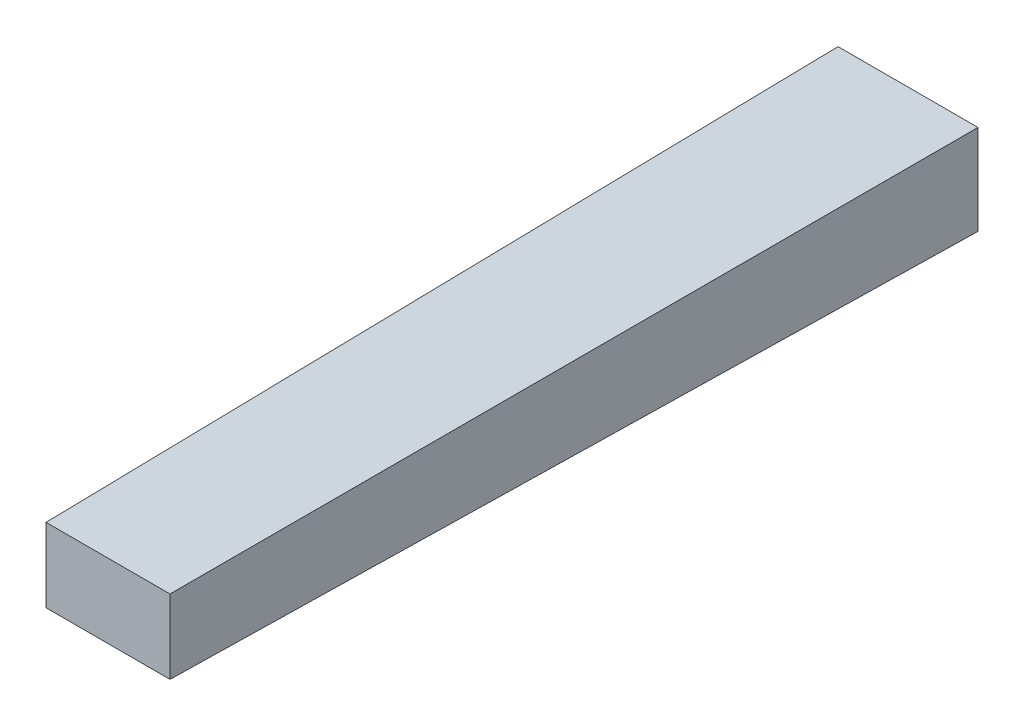
ISO-10303-21;
HEADER;
FILE_DESCRIPTION(('STEP AP214'),'2;1');
FILE_NAME('part.step','',(''),(''),'','','');
FILE_SCHEMA(('AUTOMOTIVE_DESIGN { 1 0 10303 214 1 1 1 1 }'));
ENDSEC;
DATA;
#1=APPLICATION_CONTEXT('core data for automotive mechanical design processes');
#2=APPLICATION_PROTOCOL_DEFINITION('international standard','automotive_design',2000,#1);
#3=PRODUCT_CONTEXT('',#1,'mechanical');
#4=PRODUCT('Part','Part','',(#3));
#5=PRODUCT_RELATED_PRODUCT_CATEGORY('part','',(#4));
#6=PRODUCT_DEFINITION_FORMATION('','',#4);
#7=PRODUCT_DEFINITION_CONTEXT('part definition',#1,'design');
#8=PRODUCT_DEFINITION('design','',#6,#7);
#9=PRODUCT_DEFINITION_SHAPE('','',#8);
#10=(LENGTH_UNIT() NAMED_UNIT(*) SI_UNIT(.MILLI.,.METRE.));
#11=(NAMED_UNIT(*) PLANE_ANGLE_UNIT() SI_UNIT($,.RADIAN.));
#12=(NAMED_UNIT(*) SI_UNIT($,.STERADIAN.) SOLID_ANGLE_UNIT());
#13=UNCERTAINTY_MEASURE_WITH_UNIT(LENGTH_MEASURE(1.E-05),#10,'distance_accuracy_value','');
#14=(GEOMETRIC_REPRESENTATION_CONTEXT(3) GLOBAL_UNCERTAINTY_ASSIGNED_CONTEXT((#13)) GLOBAL_UNIT_ASSIGNED_CONTEXT((#10,
#11,#12)) REPRESENTATION_CONTEXT('',''));
#15=CARTESIAN_POINT('',(0.,0.,0.));
#16=DIRECTION('',(0.,0.,1.));
#17=DIRECTION('',(1.,0.,0.));
#18=AXIS2_PLACEMENT_3D('',#15,#16,#17);
#19=CARTESIAN_POINT('',(0.,0.,0.));
#20=DIRECTION('',(-0.999949993050377,0.,0.0100005699112611));
#21=DIRECTION('',(0.0100005699112611,0.,0.999949993050378));
#22=AXIS2_PLACEMENT_3D('',#19,#20,#21);
#23=PLANE('',#22);
#24=DIRECTION('',(0.,-1.,0.));
#25=VECTOR('',#24,1.);
#26=CARTESIAN_POINT('',(0.,0.,0.));
#27=LINE('',#26,#25);
#28=CARTESIAN_POINT('',(0.,9.,0.));
#29=VERTEX_POINT('',#28);
#30=CARTESIAN_POINT('',(0.,0.,0.));
#31=VERTEX_POINT('',#30);
#32=EDGE_CURVE('E86',#29,#31,#27,.T.);
#33=ORIENTED_EDGE('',*,*,#32,.T.);
#34=DIRECTION('',(-0.0100000698632771,-0.0100000698632771,-0.99989999360209));
#35=VECTOR('',#34,1.);
#36=CARTESIAN_POINT('',(0.,0.,0.));
#37=LINE('',#36,#35);
#38=CARTESIAN_POINT('',(0.800085602741317,0.800085602741317,80.));
#39=VERTEX_POINT('',#38);
#40=EDGE_CURVE('E11',#39,#31,#37,.T.);
#41=ORIENTED_EDGE('',*,*,#40,.F.);
#42=DIRECTION('',(0.,1.,0.));
#43=VECTOR('',#42,1.);
#44=CARTESIAN_POINT('',(0.800085602741317,0.,80.));
#45=LINE('',#44,#43);
#46=CARTESIAN_POINT('',(0.800085602741317,8.19991439725868,80.));
#47=VERTEX_POINT('',#46);
#48=EDGE_CURVE('E106',#47,#39,#45,.F.);
#49=ORIENTED_EDGE('',*,*,#48,.F.);
#50=DIRECTION('',(-0.0100000698632771,0.0100000698632771,-0.99989999360209));
#51=VECTOR('',#50,1.);
#52=CARTESIAN_POINT('',(0.000900012575433804,8.99909998742457,0.0899916281308009));
#53=LINE('',#52,#51);
#54=EDGE_CURVE('E98',#47,#29,#53,.T.);
#55=ORIENTED_EDGE('',*,*,#54,.T.);
#56=EDGE_LOOP('',(#33,#41,#49,#55));
#57=FACE_BOUND('',#56,.T.);
#58=ADVANCED_FACE('F39',(#57),#23,.T.);
#59=CARTESIAN_POINT('',(0.,0.,0.));
#60=DIRECTION('',(0.,-0.999949993050377,0.0100005699112611));
#61=DIRECTION('',(0.,-0.0100005699112611,-0.999949993050378));
#62=AXIS2_PLACEMENT_3D('',#59,#60,#61);
#63=PLANE('',#62);
#64=DIRECTION('',(1.,0.,0.));
#65=VECTOR('',#64,1.);
#66=CARTESIAN_POINT('',(0.,0.,0.));
#67=LINE('',#66,#65);
#68=CARTESIAN_POINT('',(14.,0.,0.));
#69=VERTEX_POINT('',#68);
#70=EDGE_CURVE('E82',#31,#69,#67,.T.);
#71=ORIENTED_EDGE('',*,*,#70,.T.);
#72=DIRECTION('',(0.0100000698632771,-0.0100000698632771,-0.99989999360209));
#73=VECTOR('',#72,1.);
#74=CARTESIAN_POINT('',(14.,0.,0.));
#75=LINE('',#74,#73);
#76=CARTESIAN_POINT('',(13.1999143972587,0.800085602741317,80.));
#77=VERTEX_POINT('',#76);
#78=EDGE_CURVE('E49',#77,#69,#75,.T.);
#79=ORIENTED_EDGE('',*,*,#78,.F.);
#80=DIRECTION('',(-1.,0.,0.));
#81=VECTOR('',#80,1.);
#82=CARTESIAN_POINT('',(0.,0.800085602741317,80.));
#83=LINE('',#82,#81);
#84=EDGE_CURVE('E94',#39,#77,#83,.F.);
#85=ORIENTED_EDGE('',*,*,#84,.F.);
#86=ORIENTED_EDGE('',*,*,#40,.T.);
#87=EDGE_LOOP('',(#71,#79,#85,#86));
#88=FACE_BOUND('',#87,.T.);
#89=ADVANCED_FACE('F41',(#88),#63,.T.);
#90=CARTESIAN_POINT('',(14.,0.,0.));
#91=DIRECTION('',(0.999949993050377,0.,0.0100005699112611));
#92=DIRECTION('',(0.0100005699112611,0.,-0.999949993050378));
#93=AXIS2_PLACEMENT_3D('',#90,#91,#92);
#94=PLANE('',#93);
#95=DIRECTION('',(0.,1.,0.));
#96=VECTOR('',#95,1.);
#97=CARTESIAN_POINT('',(14.,0.,0.));
#98=LINE('',#97,#96);
#99=CARTESIAN_POINT('',(14.,9.,0.));
#100=VERTEX_POINT('',#99);
#101=EDGE_CURVE('E87',#69,#100,#98,.T.);
#102=ORIENTED_EDGE('',*,*,#101,.T.);
#103=DIRECTION('',(0.0100000698632771,0.0100000698632771,-0.99989999360209));
#104=VECTOR('',#103,1.);
#105=CARTESIAN_POINT('',(13.9985999804382,8.99859998043821,0.139986977092357));
#106=LINE('',#105,#104);
#107=CARTESIAN_POINT('',(13.1999143972587,8.19991439725868,80.));
#108=VERTEX_POINT('',#107);
#109=EDGE_CURVE('E110',#108,#100,#106,.T.);
#110=ORIENTED_EDGE('',*,*,#109,.F.);
#111=DIRECTION('',(0.,-1.,0.));
#112=VECTOR('',#111,1.);
#113=CARTESIAN_POINT('',(13.1999143972587,0.,80.));
#114=LINE('',#113,#112);
#115=EDGE_CURVE('E61',#77,#108,#114,.F.);
#116=ORIENTED_EDGE('',*,*,#115,.F.);
#117=ORIENTED_EDGE('',*,*,#78,.T.);
#118=EDGE_LOOP('',(#102,#110,#116,#117));
#119=FACE_BOUND('',#118,.T.);
#120=ADVANCED_FACE('F123',(#119),#94,.T.);
#121=CARTESIAN_POINT('',(0.,9.,0.));
#122=DIRECTION('',(0.,0.999949993050377,0.0100005699112611));
#123=DIRECTION('',(0.,-0.0100005699112611,0.999949993050378));
#124=AXIS2_PLACEMENT_3D('',#121,#122,#123);
#125=PLANE('',#124);
#126=DIRECTION('',(-1.,0.,0.));
#127=VECTOR('',#126,1.);
#128=CARTESIAN_POINT('',(0.,9.,0.));
#129=LINE('',#128,#127);
#130=EDGE_CURVE('E104',#100,#29,#129,.T.);
#131=ORIENTED_EDGE('',*,*,#130,.T.);
#132=ORIENTED_EDGE('',*,*,#54,.F.);
#133=DIRECTION('',(1.,0.,0.));
#134=VECTOR('',#133,1.);
#135=CARTESIAN_POINT('',(0.,8.19991439725868,80.));
#136=LINE('',#135,#134);
#137=EDGE_CURVE('E43',#108,#47,#136,.F.);
#138=ORIENTED_EDGE('',*,*,#137,.F.);
#139=ORIENTED_EDGE('',*,*,#109,.T.);
#140=EDGE_LOOP('',(#131,#132,#138,#139));
#141=FACE_BOUND('',#140,.T.);
#142=ADVANCED_FACE('F125',(#141),#125,.T.);
#143=CARTESIAN_POINT('',(0.,0.,80.));
#144=DIRECTION('',(0.,0.,-1.));
#145=DIRECTION('',(-1.,0.,0.));
#146=AXIS2_PLACEMENT_3D('',#143,#144,#145);
#147=PLANE('',#146);
#148=ORIENTED_EDGE('',*,*,#48,.T.);
#149=ORIENTED_EDGE('',*,*,#84,.T.);
#150=ORIENTED_EDGE('',*,*,#115,.T.);
#151=ORIENTED_EDGE('',*,*,#137,.T.);
#152=EDGE_LOOP('',(#148,#149,#150,#151));
#153=FACE_BOUND('',#152,.T.);
#154=ADVANCED_FACE('F121',(#153),#147,.F.);
#155=CARTESIAN_POINT('',(0.,0.,0.));
#156=DIRECTION('',(0.,0.,-1.));
#157=DIRECTION('',(-1.,0.,0.));
#158=AXIS2_PLACEMENT_3D('',#155,#156,#157);
#159=PLANE('',#158);
#160=ORIENTED_EDGE('',*,*,#32,.F.);
#161=ORIENTED_EDGE('',*,*,#130,.F.);
#162=ORIENTED_EDGE('',*,*,#101,.F.);
#163=ORIENTED_EDGE('',*,*,#70,.F.);
#164=EDGE_LOOP('',(#160,#161,#162,#163));
#165=FACE_BOUND('',#164,.T.);
#166=ADVANCED_FACE('F83',(#165),#159,.T.);
#167=CLOSED_SHELL('',(#58,#89,#120,#142,#154,#166));
#168=MANIFOLD_SOLID_BREP('B2',#167);
#169=ADVANCED_BREP_SHAPE_REPRESENTATION('',(#18,#168),#14);
#170=SHAPE_DEFINITION_REPRESENTATION(#9,#169);
ENDSEC;
END-ISO-10303-21;
